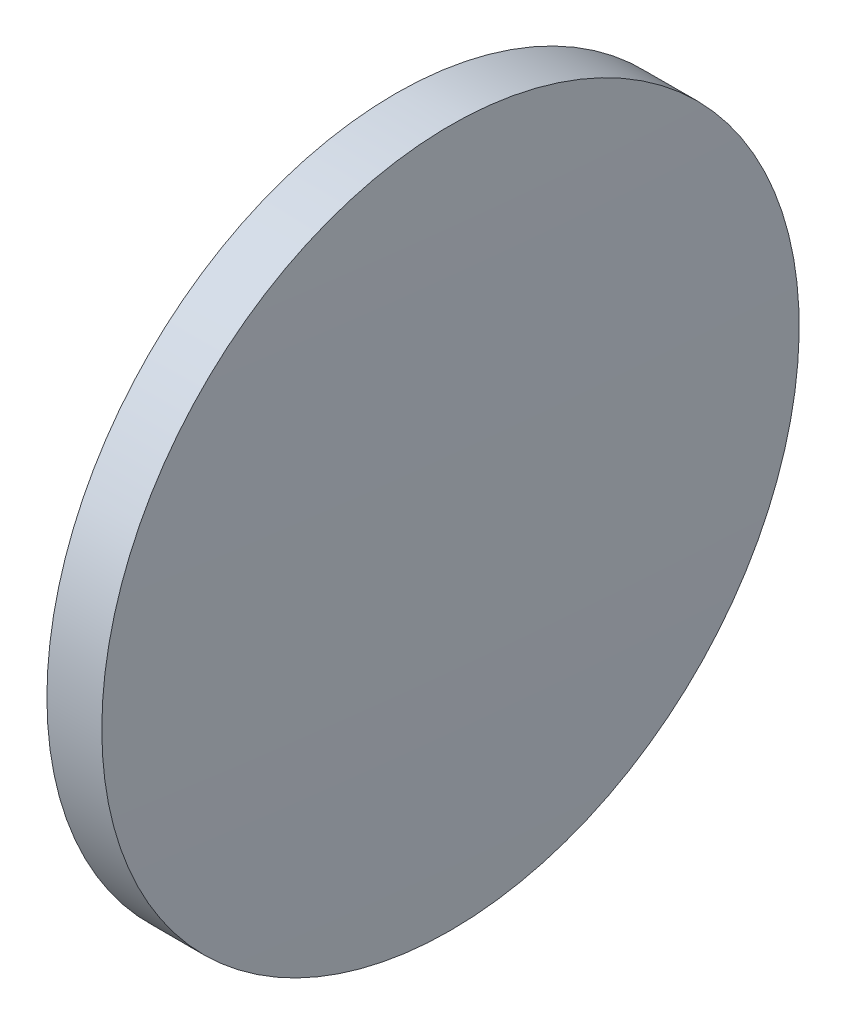
ISO-10303-21;
HEADER;
FILE_DESCRIPTION(('STEP AP214'),'2;1');
FILE_NAME('part.step','',(''),(''),'','','');
FILE_SCHEMA(('AUTOMOTIVE_DESIGN { 1 0 10303 214 1 1 1 1 }'));
ENDSEC;
DATA;
#1=APPLICATION_CONTEXT('core data for automotive mechanical design processes');
#2=APPLICATION_PROTOCOL_DEFINITION('international standard','automotive_design',2000,#1);
#3=PRODUCT_CONTEXT('',#1,'mechanical');
#4=PRODUCT('Part','Part','',(#3));
#5=PRODUCT_RELATED_PRODUCT_CATEGORY('part','',(#4));
#6=PRODUCT_DEFINITION_FORMATION('','',#4);
#7=PRODUCT_DEFINITION_CONTEXT('part definition',#1,'design');
#8=PRODUCT_DEFINITION('design','',#6,#7);
#9=PRODUCT_DEFINITION_SHAPE('','',#8);
#10=(LENGTH_UNIT() NAMED_UNIT(*) SI_UNIT(.MILLI.,.METRE.));
#11=(NAMED_UNIT(*) PLANE_ANGLE_UNIT() SI_UNIT($,.RADIAN.));
#12=(NAMED_UNIT(*) SI_UNIT($,.STERADIAN.) SOLID_ANGLE_UNIT());
#13=UNCERTAINTY_MEASURE_WITH_UNIT(LENGTH_MEASURE(1.E-05),#10,'distance_accuracy_value','');
#14=(GEOMETRIC_REPRESENTATION_CONTEXT(3) GLOBAL_UNCERTAINTY_ASSIGNED_CONTEXT((#13)) GLOBAL_UNIT_ASSIGNED_CONTEXT((#10,
#11,#12)) REPRESENTATION_CONTEXT('',''));
#15=CARTESIAN_POINT('',(0.,0.,0.));
#16=DIRECTION('',(0.,0.,1.));
#17=DIRECTION('',(1.,0.,0.));
#18=AXIS2_PLACEMENT_3D('',#15,#16,#17);
#19=CARTESIAN_POINT('',(621.959907707762,48.6161130231823,0.));
#20=DIRECTION('',(-1.,0.,0.));
#21=DIRECTION('',(0.,1.,0.));
#22=AXIS2_PLACEMENT_3D('',#19,#20,#21);
#23=SPHERICAL_SURFACE('',#22,536.651680790242);
#24=CARTESIAN_POINT('',(85.4585223460911,48.6161130231848,0.));
#25=DIRECTION('',(-1.,0.,0.));
#26=DIRECTION('',(0.,0.,1.));
#27=AXIS2_PLACEMENT_3D('',#24,#25,#26);
#28=CIRCLE('',#27,12.7);
#29=CARTESIAN_POINT('',(85.4585223460911,48.6161130231848,12.7));
#30=VERTEX_POINT('',#29);
#31=EDGE_CURVE('E41',#30,#30,#28,.T.);
#32=ORIENTED_EDGE('',*,*,#31,.T.);
#33=EDGE_LOOP('',(#32));
#34=FACE_BOUND('',#33,.T.);
#35=ADVANCED_FACE('F35',(#34),#23,.T.);
#36=CARTESIAN_POINT('',(-449.043520158224,48.6161130231865,0.));
#37=DIRECTION('',(-1.,0.,0.));
#38=DIRECTION('',(0.,-1.,0.));
#39=AXIS2_PLACEMENT_3D('',#36,#37,#38);
#40=SPHERICAL_SURFACE('',#39,536.65168079003);
#41=CARTESIAN_POINT('',(87.457865203234,48.6161130231848,0.));
#42=DIRECTION('',(-1.,0.,0.));
#43=DIRECTION('',(0.,0.,1.));
#44=AXIS2_PLACEMENT_3D('',#41,#42,#43);
#45=CIRCLE('',#44,12.7);
#46=CARTESIAN_POINT('',(87.457865203234,48.6161130231848,12.7));
#47=VERTEX_POINT('',#46);
#48=EDGE_CURVE('E10',#47,#47,#45,.T.);
#49=ORIENTED_EDGE('',*,*,#48,.F.);
#50=EDGE_LOOP('',(#49));
#51=FACE_BOUND('',#50,.T.);
#52=ADVANCED_FACE('F50',(#51),#40,.T.);
#53=CARTESIAN_POINT('',(79.3054013508372,48.6161130231848,0.));
#54=DIRECTION('',(-1.,0.,0.));
#55=DIRECTION('',(0.,0.,1.));
#56=AXIS2_PLACEMENT_3D('',#53,#54,#55);
#57=CYLINDRICAL_SURFACE('',#56,12.7);
#58=ORIENTED_EDGE('',*,*,#48,.T.);
#59=EDGE_LOOP('',(#58));
#60=FACE_BOUND('',#59,.T.);
#61=ORIENTED_EDGE('',*,*,#31,.F.);
#62=EDGE_LOOP('',(#61));
#63=FACE_BOUND('',#62,.T.);
#64=ADVANCED_FACE('F48',(#60,#63),#57,.T.);
#65=CLOSED_SHELL('',(#35,#52,#64));
#66=MANIFOLD_SOLID_BREP('B2',#65);
#67=ADVANCED_BREP_SHAPE_REPRESENTATION('',(#18,#66),#14);
#68=SHAPE_DEFINITION_REPRESENTATION(#9,#67);
ENDSEC;
END-ISO-10303-21;
